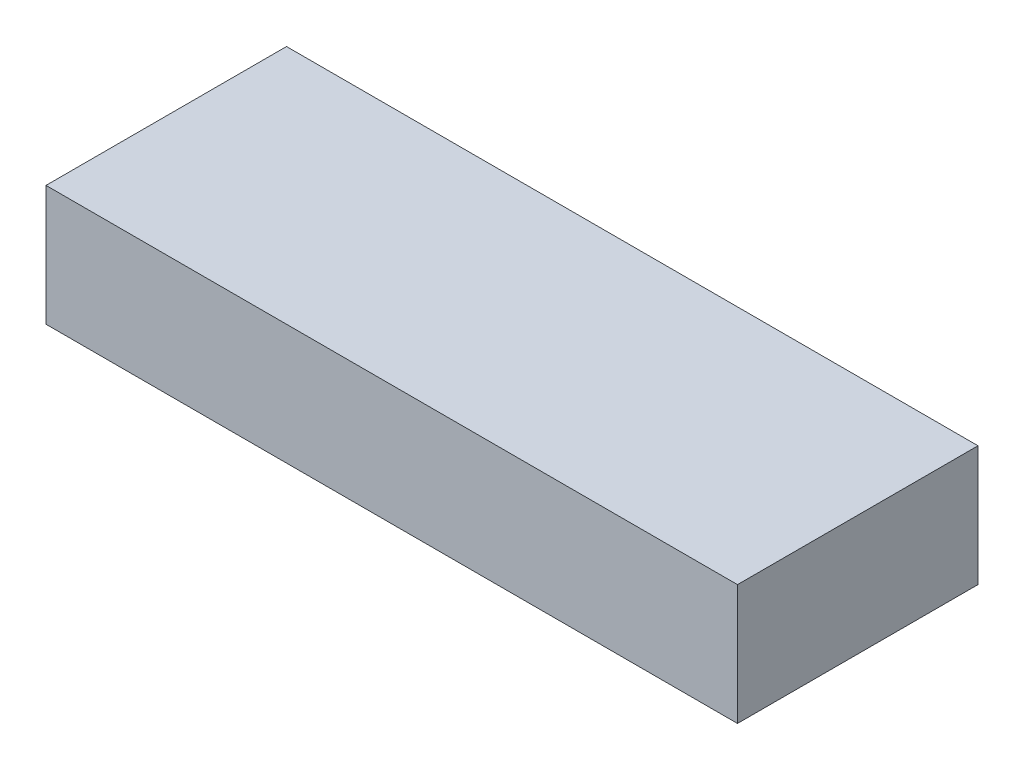
ISO-10303-21;
HEADER;
FILE_DESCRIPTION(('STEP AP214'),'2;1');
FILE_NAME('part.step','',(''),(''),'','','');
FILE_SCHEMA(('AUTOMOTIVE_DESIGN { 1 0 10303 214 1 1 1 1 }'));
ENDSEC;
DATA;
#1=APPLICATION_CONTEXT('core data for automotive mechanical design processes');
#2=APPLICATION_PROTOCOL_DEFINITION('international standard','automotive_design',2000,#1);
#3=PRODUCT_CONTEXT('',#1,'mechanical');
#4=PRODUCT('Part','Part','',(#3));
#5=PRODUCT_RELATED_PRODUCT_CATEGORY('part','',(#4));
#6=PRODUCT_DEFINITION_FORMATION('','',#4);
#7=PRODUCT_DEFINITION_CONTEXT('part definition',#1,'design');
#8=PRODUCT_DEFINITION('design','',#6,#7);
#9=PRODUCT_DEFINITION_SHAPE('','',#8);
#10=(LENGTH_UNIT() NAMED_UNIT(*) SI_UNIT(.MILLI.,.METRE.));
#11=(NAMED_UNIT(*) PLANE_ANGLE_UNIT() SI_UNIT($,.RADIAN.));
#12=(NAMED_UNIT(*) SI_UNIT($,.STERADIAN.) SOLID_ANGLE_UNIT());
#13=UNCERTAINTY_MEASURE_WITH_UNIT(LENGTH_MEASURE(1.E-05),#10,'distance_accuracy_value','');
#14=(GEOMETRIC_REPRESENTATION_CONTEXT(3) GLOBAL_UNCERTAINTY_ASSIGNED_CONTEXT((#13)) GLOBAL_UNIT_ASSIGNED_CONTEXT((#10,
#11,#12)) REPRESENTATION_CONTEXT('',''));
#15=CARTESIAN_POINT('',(0.,0.,0.));
#16=DIRECTION('',(0.,0.,1.));
#17=DIRECTION('',(1.,0.,0.));
#18=AXIS2_PLACEMENT_3D('',#15,#16,#17);
#19=CARTESIAN_POINT('',(0.,25.4,-25.4));
#20=DIRECTION('',(1.,0.,0.));
#21=DIRECTION('',(0.,0.,-1.));
#22=AXIS2_PLACEMENT_3D('',#19,#20,#21);
#23=PLANE('',#22);
#24=DIRECTION('',(0.,0.,1.));
#25=VECTOR('',#24,1.);
#26=CARTESIAN_POINT('',(0.,0.,-25.4));
#27=LINE('',#26,#25);
#28=CARTESIAN_POINT('',(0.,0.,-25.4));
#29=VERTEX_POINT('',#28);
#30=CARTESIAN_POINT('',(0.,0.,25.4));
#31=VERTEX_POINT('',#30);
#32=EDGE_CURVE('E99',#29,#31,#27,.T.);
#33=ORIENTED_EDGE('',*,*,#32,.T.);
#34=DIRECTION('',(0.,-1.,0.));
#35=VECTOR('',#34,1.);
#36=CARTESIAN_POINT('',(0.,25.4,25.4));
#37=LINE('',#36,#35);
#38=CARTESIAN_POINT('',(0.,25.4,25.4));
#39=VERTEX_POINT('',#38);
#40=EDGE_CURVE('E11',#39,#31,#37,.T.);
#41=ORIENTED_EDGE('',*,*,#40,.F.);
#42=DIRECTION('',(0.,0.,1.));
#43=VECTOR('',#42,1.);
#44=CARTESIAN_POINT('',(0.,25.4,-25.4));
#45=LINE('',#44,#43);
#46=CARTESIAN_POINT('',(0.,25.4,-25.4));
#47=VERTEX_POINT('',#46);
#48=EDGE_CURVE('E87',#47,#39,#45,.T.);
#49=ORIENTED_EDGE('',*,*,#48,.F.);
#50=DIRECTION('',(0.,-1.,0.));
#51=VECTOR('',#50,1.);
#52=CARTESIAN_POINT('',(0.,25.4,-25.4));
#53=LINE('',#52,#51);
#54=EDGE_CURVE('E95',#47,#29,#53,.T.);
#55=ORIENTED_EDGE('',*,*,#54,.T.);
#56=EDGE_LOOP('',(#33,#41,#49,#55));
#57=FACE_BOUND('',#56,.T.);
#58=ADVANCED_FACE('F36',(#57),#23,.F.);
#59=CARTESIAN_POINT('',(0.,25.4,25.4));
#60=DIRECTION('',(0.,0.,-1.));
#61=DIRECTION('',(-1.,0.,0.));
#62=AXIS2_PLACEMENT_3D('',#59,#60,#61);
#63=PLANE('',#62);
#64=DIRECTION('',(1.,0.,0.));
#65=VECTOR('',#64,1.);
#66=CARTESIAN_POINT('',(0.,0.,25.4));
#67=LINE('',#66,#65);
#68=CARTESIAN_POINT('',(146.05,0.,25.4));
#69=VERTEX_POINT('',#68);
#70=EDGE_CURVE('E91',#31,#69,#67,.T.);
#71=ORIENTED_EDGE('',*,*,#70,.T.);
#72=DIRECTION('',(0.,-1.,0.));
#73=VECTOR('',#72,1.);
#74=CARTESIAN_POINT('',(146.05,25.4,25.4));
#75=LINE('',#74,#73);
#76=CARTESIAN_POINT('',(146.05,25.4,25.4));
#77=VERTEX_POINT('',#76);
#78=EDGE_CURVE('E44',#77,#69,#75,.T.);
#79=ORIENTED_EDGE('',*,*,#78,.F.);
#80=DIRECTION('',(1.,0.,0.));
#81=VECTOR('',#80,1.);
#82=CARTESIAN_POINT('',(0.,25.4,25.4));
#83=LINE('',#82,#81);
#84=EDGE_CURVE('E82',#39,#77,#83,.T.);
#85=ORIENTED_EDGE('',*,*,#84,.F.);
#86=ORIENTED_EDGE('',*,*,#40,.T.);
#87=EDGE_LOOP('',(#71,#79,#85,#86));
#88=FACE_BOUND('',#87,.T.);
#89=ADVANCED_FACE('F90',(#88),#63,.F.);
#90=CARTESIAN_POINT('',(146.05,25.4,-25.4));
#91=DIRECTION('',(-1.,0.,0.));
#92=DIRECTION('',(0.,0.,1.));
#93=AXIS2_PLACEMENT_3D('',#90,#91,#92);
#94=PLANE('',#93);
#95=DIRECTION('',(0.,0.,-1.));
#96=VECTOR('',#95,1.);
#97=CARTESIAN_POINT('',(146.05,0.,-25.4));
#98=LINE('',#97,#96);
#99=CARTESIAN_POINT('',(146.05,0.,-25.4));
#100=VERTEX_POINT('',#99);
#101=EDGE_CURVE('E69',#69,#100,#98,.T.);
#102=ORIENTED_EDGE('',*,*,#101,.T.);
#103=DIRECTION('',(0.,-1.,0.));
#104=VECTOR('',#103,1.);
#105=CARTESIAN_POINT('',(146.05,25.4,-25.4));
#106=LINE('',#105,#104);
#107=CARTESIAN_POINT('',(146.05,25.4,-25.4));
#108=VERTEX_POINT('',#107);
#109=EDGE_CURVE('E92',#108,#100,#106,.T.);
#110=ORIENTED_EDGE('',*,*,#109,.F.);
#111=DIRECTION('',(0.,0.,-1.));
#112=VECTOR('',#111,1.);
#113=CARTESIAN_POINT('',(146.05,25.4,-25.4));
#114=LINE('',#113,#112);
#115=EDGE_CURVE('E85',#77,#108,#114,.T.);
#116=ORIENTED_EDGE('',*,*,#115,.F.);
#117=ORIENTED_EDGE('',*,*,#78,.T.);
#118=EDGE_LOOP('',(#102,#110,#116,#117));
#119=FACE_BOUND('',#118,.T.);
#120=ADVANCED_FACE('F93',(#119),#94,.F.);
#121=CARTESIAN_POINT('',(0.,25.4,-25.4));
#122=DIRECTION('',(0.,0.,1.));
#123=DIRECTION('',(1.,0.,0.));
#124=AXIS2_PLACEMENT_3D('',#121,#122,#123);
#125=PLANE('',#124);
#126=DIRECTION('',(-1.,0.,0.));
#127=VECTOR('',#126,1.);
#128=CARTESIAN_POINT('',(0.,0.,-25.4));
#129=LINE('',#128,#127);
#130=EDGE_CURVE('E75',#100,#29,#129,.T.);
#131=ORIENTED_EDGE('',*,*,#130,.T.);
#132=ORIENTED_EDGE('',*,*,#54,.F.);
#133=DIRECTION('',(-1.,0.,0.));
#134=VECTOR('',#133,1.);
#135=CARTESIAN_POINT('',(0.,25.4,-25.4));
#136=LINE('',#135,#134);
#137=EDGE_CURVE('E52',#108,#47,#136,.T.);
#138=ORIENTED_EDGE('',*,*,#137,.F.);
#139=ORIENTED_EDGE('',*,*,#109,.T.);
#140=EDGE_LOOP('',(#131,#132,#138,#139));
#141=FACE_BOUND('',#140,.T.);
#142=ADVANCED_FACE('F106',(#141),#125,.F.);
#143=CARTESIAN_POINT('',(0.,25.4,0.));
#144=DIRECTION('',(0.,1.,0.));
#145=DIRECTION('',(0.,0.,1.));
#146=AXIS2_PLACEMENT_3D('',#143,#144,#145);
#147=PLANE('',#146);
#148=ORIENTED_EDGE('',*,*,#48,.T.);
#149=ORIENTED_EDGE('',*,*,#84,.T.);
#150=ORIENTED_EDGE('',*,*,#115,.T.);
#151=ORIENTED_EDGE('',*,*,#137,.T.);
#152=EDGE_LOOP('',(#148,#149,#150,#151));
#153=FACE_BOUND('',#152,.T.);
#154=ADVANCED_FACE('F83',(#153),#147,.T.);
#155=CARTESIAN_POINT('',(0.,0.,0.));
#156=DIRECTION('',(0.,1.,0.));
#157=DIRECTION('',(0.,0.,1.));
#158=AXIS2_PLACEMENT_3D('',#155,#156,#157);
#159=PLANE('',#158);
#160=ORIENTED_EDGE('',*,*,#32,.F.);
#161=ORIENTED_EDGE('',*,*,#130,.F.);
#162=ORIENTED_EDGE('',*,*,#101,.F.);
#163=ORIENTED_EDGE('',*,*,#70,.F.);
#164=EDGE_LOOP('',(#160,#161,#162,#163));
#165=FACE_BOUND('',#164,.T.);
#166=ADVANCED_FACE('F109',(#165),#159,.F.);
#167=CLOSED_SHELL('',(#58,#89,#120,#142,#154,#166));
#168=MANIFOLD_SOLID_BREP('B2',#167);
#169=ADVANCED_BREP_SHAPE_REPRESENTATION('',(#18,#168),#14);
#170=SHAPE_DEFINITION_REPRESENTATION(#9,#169);
ENDSEC;
END-ISO-10303-21;
